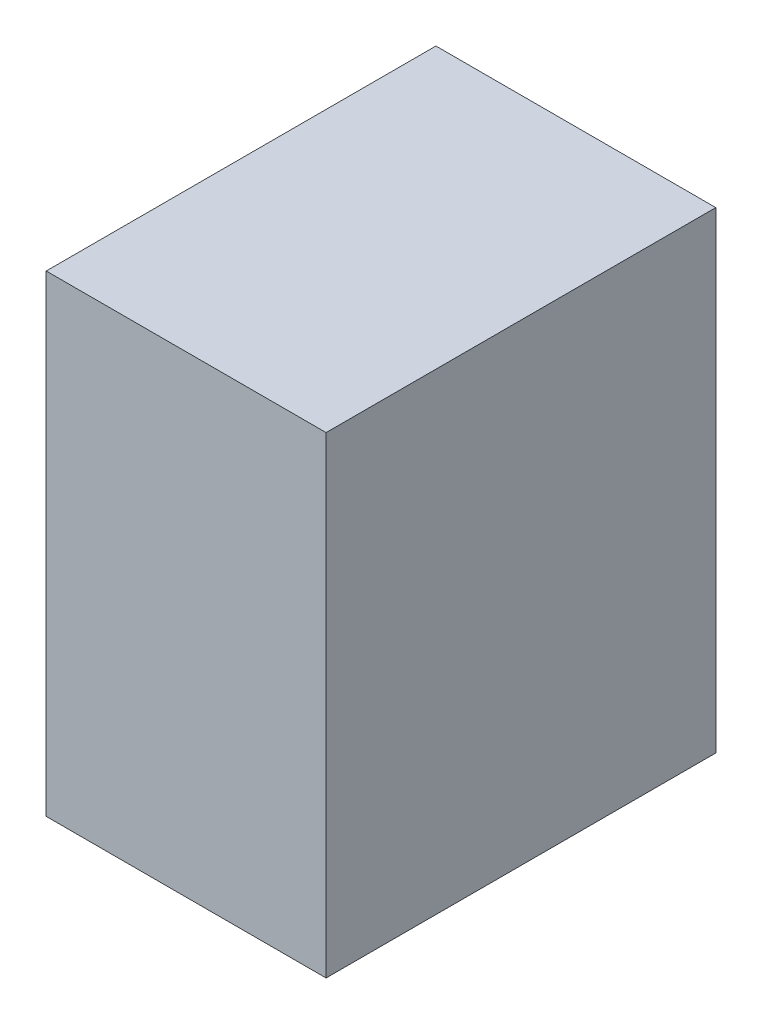
ISO-10303-21;
HEADER;
FILE_DESCRIPTION(('STEP AP214'),'2;1');
FILE_NAME('part.step','',(''),(''),'','','');
FILE_SCHEMA(('AUTOMOTIVE_DESIGN { 1 0 10303 214 1 1 1 1 }'));
ENDSEC;
DATA;
#1=APPLICATION_CONTEXT('core data for automotive mechanical design processes');
#2=APPLICATION_PROTOCOL_DEFINITION('international standard','automotive_design',2000,#1);
#3=PRODUCT_CONTEXT('',#1,'mechanical');
#4=PRODUCT('Part','Part','',(#3));
#5=PRODUCT_RELATED_PRODUCT_CATEGORY('part','',(#4));
#6=PRODUCT_DEFINITION_FORMATION('','',#4);
#7=PRODUCT_DEFINITION_CONTEXT('part definition',#1,'design');
#8=PRODUCT_DEFINITION('design','',#6,#7);
#9=PRODUCT_DEFINITION_SHAPE('','',#8);
#10=(LENGTH_UNIT() NAMED_UNIT(*) SI_UNIT(.MILLI.,.METRE.));
#11=(NAMED_UNIT(*) PLANE_ANGLE_UNIT() SI_UNIT($,.RADIAN.));
#12=(NAMED_UNIT(*) SI_UNIT($,.STERADIAN.) SOLID_ANGLE_UNIT());
#13=UNCERTAINTY_MEASURE_WITH_UNIT(LENGTH_MEASURE(1.E-05),#10,'distance_accuracy_value','');
#14=(GEOMETRIC_REPRESENTATION_CONTEXT(3) GLOBAL_UNCERTAINTY_ASSIGNED_CONTEXT((#13)) GLOBAL_UNIT_ASSIGNED_CONTEXT((#10,
#11,#12)) REPRESENTATION_CONTEXT('',''));
#15=CARTESIAN_POINT('',(0.,0.,0.));
#16=DIRECTION('',(0.,0.,1.));
#17=DIRECTION('',(1.,0.,0.));
#18=AXIS2_PLACEMENT_3D('',#15,#16,#17);
#19=CARTESIAN_POINT('',(0.0655,0.2,0.));
#20=DIRECTION('',(1.,0.,0.));
#21=DIRECTION('',(0.,0.,-1.));
#22=AXIS2_PLACEMENT_3D('',#19,#20,#21);
#23=PLANE('',#22);
#24=DIRECTION('',(0.,0.,-1.));
#25=VECTOR('',#24,1.);
#26=CARTESIAN_POINT('',(0.0655,-0.2,0.));
#27=LINE('',#26,#25);
#28=CARTESIAN_POINT('',(0.0655,-0.2,0.));
#29=VERTEX_POINT('',#28);
#30=CARTESIAN_POINT('',(0.0655,-0.2,0.33));
#31=VERTEX_POINT('',#30);
#32=EDGE_CURVE('E19',#29,#31,#27,.F.);
#33=ORIENTED_EDGE('',*,*,#32,.F.);
#34=DIRECTION('',(0.,1.,0.));
#35=VECTOR('',#34,1.);
#36=CARTESIAN_POINT('',(0.0655,-0.2,0.));
#37=LINE('',#36,#35);
#38=CARTESIAN_POINT('',(0.0655,0.2,0.));
#39=VERTEX_POINT('',#38);
#40=EDGE_CURVE('E79',#29,#39,#37,.T.);
#41=ORIENTED_EDGE('',*,*,#40,.T.);
#42=DIRECTION('',(0.,0.,1.));
#43=VECTOR('',#42,1.);
#44=CARTESIAN_POINT('',(0.0655,0.2,0.));
#45=LINE('',#44,#43);
#46=CARTESIAN_POINT('',(0.0655,0.2,0.33));
#47=VERTEX_POINT('',#46);
#48=EDGE_CURVE('E67',#47,#39,#45,.F.);
#49=ORIENTED_EDGE('',*,*,#48,.F.);
#50=DIRECTION('',(0.,1.,0.));
#51=VECTOR('',#50,1.);
#52=CARTESIAN_POINT('',(0.0655,-0.2,0.33));
#53=LINE('',#52,#51);
#54=EDGE_CURVE('E55',#31,#47,#53,.T.);
#55=ORIENTED_EDGE('',*,*,#54,.F.);
#56=EDGE_LOOP('',(#33,#41,#49,#55));
#57=FACE_BOUND('',#56,.T.);
#58=ADVANCED_FACE('F16',(#57),#23,.T.);
#59=CARTESIAN_POINT('',(0.0655,-0.2,0.));
#60=DIRECTION('',(0.,-1.,0.));
#61=DIRECTION('',(0.,0.,-1.));
#62=AXIS2_PLACEMENT_3D('',#59,#60,#61);
#63=PLANE('',#62);
#64=DIRECTION('',(0.,0.,1.));
#65=VECTOR('',#64,1.);
#66=CARTESIAN_POINT('',(-0.1715,-0.2,0.));
#67=LINE('',#66,#65);
#68=CARTESIAN_POINT('',(-0.1715,-0.2,0.));
#69=VERTEX_POINT('',#68);
#70=CARTESIAN_POINT('',(-0.1715,-0.2,0.33));
#71=VERTEX_POINT('',#70);
#72=EDGE_CURVE('E82',#69,#71,#67,.T.);
#73=ORIENTED_EDGE('',*,*,#72,.F.);
#74=DIRECTION('',(1.,0.,0.));
#75=VECTOR('',#74,1.);
#76=CARTESIAN_POINT('',(-0.1715,-0.2,0.));
#77=LINE('',#76,#75);
#78=EDGE_CURVE('E64',#69,#29,#77,.T.);
#79=ORIENTED_EDGE('',*,*,#78,.T.);
#80=ORIENTED_EDGE('',*,*,#32,.T.);
#81=DIRECTION('',(1.,0.,0.));
#82=VECTOR('',#81,1.);
#83=CARTESIAN_POINT('',(-0.1715,-0.2,0.33));
#84=LINE('',#83,#82);
#85=EDGE_CURVE('E61',#71,#31,#84,.T.);
#86=ORIENTED_EDGE('',*,*,#85,.F.);
#87=EDGE_LOOP('',(#73,#79,#80,#86));
#88=FACE_BOUND('',#87,.T.);
#89=ADVANCED_FACE('F60',(#88),#63,.T.);
#90=CARTESIAN_POINT('',(-0.1715,-0.2,0.33));
#91=DIRECTION('',(0.,0.,1.));
#92=DIRECTION('',(1.,0.,0.));
#93=AXIS2_PLACEMENT_3D('',#90,#91,#92);
#94=PLANE('',#93);
#95=DIRECTION('',(1.,0.,0.));
#96=VECTOR('',#95,1.);
#97=CARTESIAN_POINT('',(-0.1715,0.2,0.33));
#98=LINE('',#97,#96);
#99=CARTESIAN_POINT('',(-0.1715,0.2,0.33));
#100=VERTEX_POINT('',#99);
#101=EDGE_CURVE('E69',#100,#47,#98,.T.);
#102=ORIENTED_EDGE('',*,*,#101,.F.);
#103=DIRECTION('',(0.,1.,0.));
#104=VECTOR('',#103,1.);
#105=CARTESIAN_POINT('',(-0.1715,-0.2,0.33));
#106=LINE('',#105,#104);
#107=EDGE_CURVE('E73',#71,#100,#106,.T.);
#108=ORIENTED_EDGE('',*,*,#107,.F.);
#109=ORIENTED_EDGE('',*,*,#85,.T.);
#110=ORIENTED_EDGE('',*,*,#54,.T.);
#111=EDGE_LOOP('',(#102,#108,#109,#110));
#112=FACE_BOUND('',#111,.T.);
#113=ADVANCED_FACE('F71',(#112),#94,.T.);
#114=CARTESIAN_POINT('',(-0.1715,0.2,0.));
#115=DIRECTION('',(0.,1.,0.));
#116=DIRECTION('',(0.,0.,1.));
#117=AXIS2_PLACEMENT_3D('',#114,#115,#116);
#118=PLANE('',#117);
#119=ORIENTED_EDGE('',*,*,#48,.T.);
#120=DIRECTION('',(1.,0.,0.));
#121=VECTOR('',#120,1.);
#122=CARTESIAN_POINT('',(-0.1715,0.2,0.));
#123=LINE('',#122,#121);
#124=CARTESIAN_POINT('',(-0.1715,0.2,0.));
#125=VERTEX_POINT('',#124);
#126=EDGE_CURVE('E34',#39,#125,#123,.F.);
#127=ORIENTED_EDGE('',*,*,#126,.T.);
#128=DIRECTION('',(0.,0.,1.));
#129=VECTOR('',#128,1.);
#130=CARTESIAN_POINT('',(-0.1715,0.2,0.));
#131=LINE('',#130,#129);
#132=EDGE_CURVE('E25',#100,#125,#131,.F.);
#133=ORIENTED_EDGE('',*,*,#132,.F.);
#134=ORIENTED_EDGE('',*,*,#101,.T.);
#135=EDGE_LOOP('',(#119,#127,#133,#134));
#136=FACE_BOUND('',#135,.T.);
#137=ADVANCED_FACE('F88',(#136),#118,.T.);
#138=CARTESIAN_POINT('',(-0.1715,-0.2,0.));
#139=DIRECTION('',(0.,0.,1.));
#140=DIRECTION('',(1.,0.,0.));
#141=AXIS2_PLACEMENT_3D('',#138,#139,#140);
#142=PLANE('',#141);
#143=ORIENTED_EDGE('',*,*,#126,.F.);
#144=ORIENTED_EDGE('',*,*,#40,.F.);
#145=ORIENTED_EDGE('',*,*,#78,.F.);
#146=DIRECTION('',(0.,1.,0.));
#147=VECTOR('',#146,1.);
#148=CARTESIAN_POINT('',(-0.1715,-0.2,0.));
#149=LINE('',#148,#147);
#150=EDGE_CURVE('E11',#125,#69,#149,.F.);
#151=ORIENTED_EDGE('',*,*,#150,.F.);
#152=EDGE_LOOP('',(#143,#144,#145,#151));
#153=FACE_BOUND('',#152,.T.);
#154=ADVANCED_FACE('F90',(#153),#142,.F.);
#155=CARTESIAN_POINT('',(-0.1715,-0.2,0.));
#156=DIRECTION('',(-1.,0.,0.));
#157=DIRECTION('',(0.,0.,1.));
#158=AXIS2_PLACEMENT_3D('',#155,#156,#157);
#159=PLANE('',#158);
#160=ORIENTED_EDGE('',*,*,#132,.T.);
#161=ORIENTED_EDGE('',*,*,#150,.T.);
#162=ORIENTED_EDGE('',*,*,#72,.T.);
#163=ORIENTED_EDGE('',*,*,#107,.T.);
#164=EDGE_LOOP('',(#160,#161,#162,#163));
#165=FACE_BOUND('',#164,.T.);
#166=ADVANCED_FACE('F87',(#165),#159,.T.);
#167=CLOSED_SHELL('',(#58,#89,#113,#137,#154,#166));
#168=MANIFOLD_SOLID_BREP('B1',#167);
#169=ADVANCED_BREP_SHAPE_REPRESENTATION('',(#18,#168),#14);
#170=SHAPE_DEFINITION_REPRESENTATION(#9,#169);
ENDSEC;
END-ISO-10303-21;
